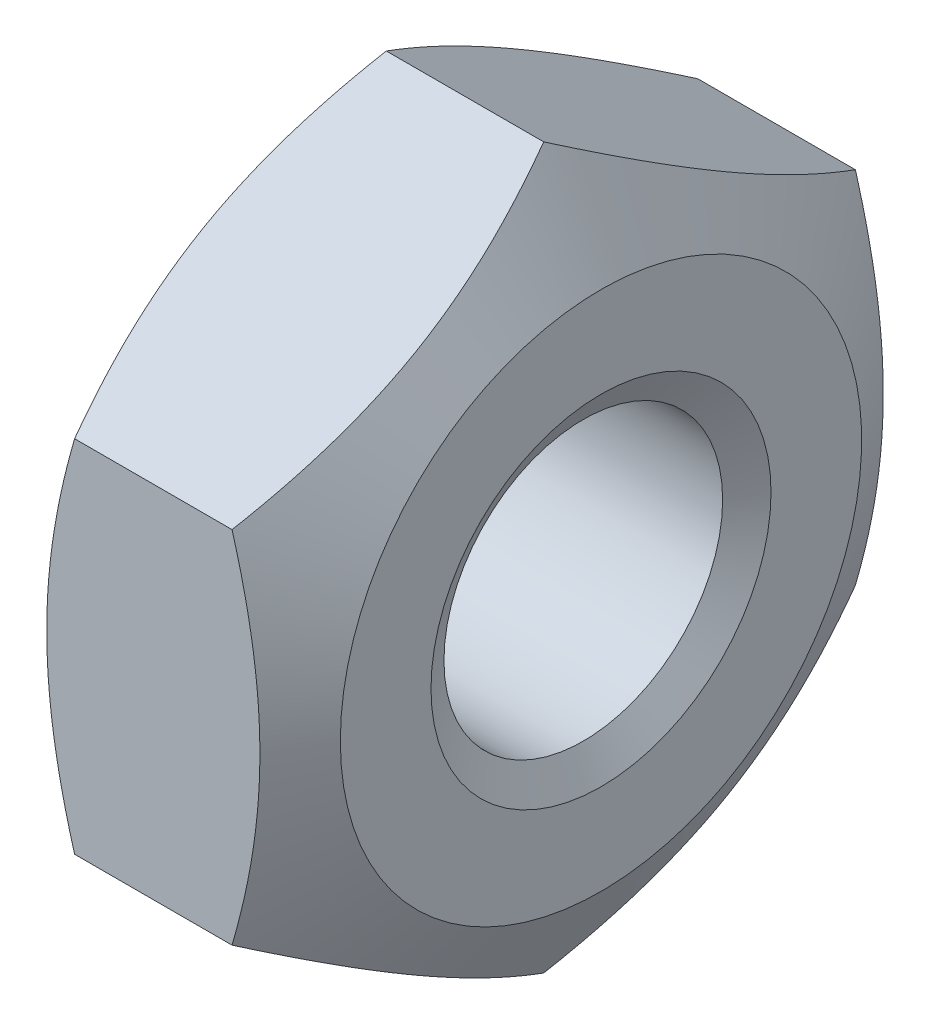
ISO-10303-21;
HEADER;
FILE_DESCRIPTION(('STEP AP214'),'2;1');
FILE_NAME('part.step','',(''),(''),'','','');
FILE_SCHEMA(('AUTOMOTIVE_DESIGN { 1 0 10303 214 1 1 1 1 }'));
ENDSEC;
DATA;
#1=APPLICATION_CONTEXT('core data for automotive mechanical design processes');
#2=APPLICATION_PROTOCOL_DEFINITION('international standard','automotive_design',2000,#1);
#3=PRODUCT_CONTEXT('',#1,'mechanical');
#4=PRODUCT('Part','Part','',(#3));
#5=PRODUCT_RELATED_PRODUCT_CATEGORY('part','',(#4));
#6=PRODUCT_DEFINITION_FORMATION('','',#4);
#7=PRODUCT_DEFINITION_CONTEXT('part definition',#1,'design');
#8=PRODUCT_DEFINITION('design','',#6,#7);
#9=PRODUCT_DEFINITION_SHAPE('','',#8);
#10=(LENGTH_UNIT() NAMED_UNIT(*) SI_UNIT(.MILLI.,.METRE.));
#11=(NAMED_UNIT(*) PLANE_ANGLE_UNIT() SI_UNIT($,.RADIAN.));
#12=(NAMED_UNIT(*) SI_UNIT($,.STERADIAN.) SOLID_ANGLE_UNIT());
#13=UNCERTAINTY_MEASURE_WITH_UNIT(LENGTH_MEASURE(1.E-05),#10,'distance_accuracy_value','');
#14=(GEOMETRIC_REPRESENTATION_CONTEXT(3) GLOBAL_UNCERTAINTY_ASSIGNED_CONTEXT((#13)) GLOBAL_UNIT_ASSIGNED_CONTEXT((#10,
#11,#12)) REPRESENTATION_CONTEXT('',''));
#15=CARTESIAN_POINT('',(0.,0.,0.));
#16=DIRECTION('',(0.,0.,1.));
#17=DIRECTION('',(1.,0.,0.));
#18=AXIS2_PLACEMENT_3D('',#15,#16,#17);
#19=CARTESIAN_POINT('',(0.,-1.58771324027147,-2.75000000000001));
#20=DIRECTION('',(0.,-0.866025403784438,-0.5));
#21=DIRECTION('',(0.,0.5,-0.866025403784438));
#22=AXIS2_PLACEMENT_3D('',#19,#20,#21);
#23=PLANE('',#22);
#24=CARTESIAN_POINT('',(1.89457227081406,-3.17542645956917,1.05677370736381E-08));
#25=CARTESIAN_POINT('',(1.93486590586192,-3.10565609170779,-0.120845841483615));
#26=CARTESIAN_POINT('',(1.97151085352844,-3.03528345852249,-0.242734829951547));
#27=CARTESIAN_POINT('',(2.0354735051396,-2.89331972966931,-0.488623230196292));
#28=CARTESIAN_POINT('',(2.06276858399163,-2.82172611238506,-0.612627009503181));
#29=CARTESIAN_POINT('',(2.10525534272448,-2.67942610375502,-0.859097852001737));
#30=CARTESIAN_POINT('',(2.12072982850071,-2.60874160090861,-0.981527003096313));
#31=CARTESIAN_POINT('',(2.13919968008389,-2.46704017425595,-1.22696107418617));
#32=CARTESIAN_POINT('',(2.14221034418956,-2.3960237651429,-1.34996510270803));
#33=CARTESIAN_POINT('',(2.13593113617861,-2.26333722314919,-1.57978493477586));
#34=CARTESIAN_POINT('',(2.12818301754884,-2.20164717955248,-1.6866352246561));
#35=CARTESIAN_POINT('',(2.10363099522736,-2.07866898287502,-1.89963970956128));
#36=CARTESIAN_POINT('',(2.08681871282409,-2.0173812548254,-2.00579316841064));
#37=CARTESIAN_POINT('',(2.04479126098825,-1.89414971139675,-2.21923646271352));
#38=CARTESIAN_POINT('',(2.01939802304476,-1.83222148476626,-2.32649929766287));
#39=CARTESIAN_POINT('',(1.96176610839163,-1.7092884238522,-2.53942560510136));
#40=CARTESIAN_POINT('',(1.92954096419356,-1.64828201586918,-2.64509180331791));
#41=CARTESIAN_POINT('',(1.8945722778935,-1.58771322661182,-2.75000002365922));
#42=B_SPLINE_CURVE_WITH_KNOTS('',3,(#24,#25,#26,#27,#28,#29,#30,#31,#32,#33,#34,#35,#36,#37,#38,
#39,#40,#41),.UNSPECIFIED.,.F.,.F.,(4,2,2,2,2,2,2,2,4),(0.,0.435897020207212,0.872841506597175,
1.29897296964876,1.72458123661091,2.09509821932502,2.46595828840692,2.84504225726385,
3.22338224444981),.UNSPECIFIED.);
#43=CARTESIAN_POINT('',(1.89457229259446,-3.17542646873979,2.04436595744794E-08));
#44=VERTEX_POINT('',#43);
#45=CARTESIAN_POINT('',(1.89457228097589,-1.58771323195066,-2.75000001441206));
#46=VERTEX_POINT('',#45);
#47=EDGE_CURVE('E168',#44,#46,#42,.T.);
#48=ORIENTED_EDGE('',*,*,#47,.F.);
#49=DIRECTION('',(1.,0.,0.));
#50=VECTOR('',#49,1.);
#51=CARTESIAN_POINT('',(0.,-3.17542648054294,0.));
#52=LINE('',#51,#50);
#53=CARTESIAN_POINT('',(0.505427707428921,-3.17542646874066,-2.0442152704221E-08));
#54=VERTEX_POINT('',#53);
#55=EDGE_CURVE('E87',#54,#44,#52,.T.);
#56=ORIENTED_EDGE('',*,*,#55,.F.);
#57=CARTESIAN_POINT('',(0.505427746507373,-1.58771319443364,-2.75000000441103));
#58=CARTESIAN_POINT('',(0.465134105039347,-1.65748359604145,-2.62915417201391));
#59=CARTESIAN_POINT('',(0.428489154182361,-1.72785624345342,-2.50726519094581));
#60=CARTESIAN_POINT('',(0.364526499117004,-1.86981998354074,-2.26137679473498));
#61=CARTESIAN_POINT('',(0.337231420003046,-1.94141359779052,-2.1373730120371));
#62=CARTESIAN_POINT('',(0.294744660121934,-2.08371360503,-1.89090216579758));
#63=CARTESIAN_POINT('',(0.279270173465292,-2.15439810940401,-1.76847301428399));
#64=CARTESIAN_POINT('',(0.260800320495573,-2.29609953795851,-1.52303894151777));
#65=CARTESIAN_POINT('',(0.257789655886369,-2.36711594744735,-1.40003491173938));
#66=CARTESIAN_POINT('',(0.264068862977007,-2.49980248732801,-1.17021508295227));
#67=CARTESIAN_POINT('',(0.271816980675713,-2.56149252839911,-1.06336479757543));
#68=CARTESIAN_POINT('',(0.296369000451132,-2.68447072000099,-0.850360321556576));
#69=CARTESIAN_POINT('',(0.313181281236138,-2.74575844550078,-0.744206867089759));
#70=CARTESIAN_POINT('',(0.355208729269278,-2.86898998384326,-0.530763581568637));
#71=CARTESIAN_POINT('',(0.380601965013055,-2.9309182079399,-0.423500751015073));
#72=CARTESIAN_POINT('',(0.438233874923238,-3.05385126389786,-0.210574452174787));
#73=CARTESIAN_POINT('',(0.470459016582293,-3.11485766945809,-0.104908258161618));
#74=CARTESIAN_POINT('',(0.505427700255913,-3.17542645631665,-4.19611834037509E-08));
#75=B_SPLINE_CURVE_WITH_KNOTS('',3,(#57,#58,#59,#60,#61,#62,#63,#64,#65,#66,#67,#68,#69,#70,#71,
#72,#73,#74),.UNSPECIFIED.,.F.,.F.,(4,2,2,2,2,2,2,2,4),(0.,0.435897024645075,0.87284151524282,
1.29897298200455,1.72458125277711,2.09509821991256,2.46595827329287,2.84504222592937,
3.22338219711898),.UNSPECIFIED.);
#76=CARTESIAN_POINT('',(0.505427701742238,-1.58771319696766,-2.75000000000001));
#77=VERTEX_POINT('',#76);
#78=EDGE_CURVE('E169',#77,#54,#75,.T.);
#79=ORIENTED_EDGE('',*,*,#78,.F.);
#80=DIRECTION('',(1.,0.,0.));
#81=VECTOR('',#80,1.);
#82=CARTESIAN_POINT('',(0.,-1.58771324027146,-2.75000000000001));
#83=LINE('',#82,#81);
#84=EDGE_CURVE('E230',#46,#77,#83,.F.);
#85=ORIENTED_EDGE('',*,*,#84,.F.);
#86=EDGE_LOOP('',(#48,#56,#79,#85));
#87=FACE_BOUND('',#86,.T.);
#88=ADVANCED_FACE('F19',(#87),#23,.T.);
#89=CARTESIAN_POINT('',(0.,1.58771324027148,-2.75));
#90=DIRECTION('',(0.,0.,-1.));
#91=DIRECTION('',(0.,1.,0.));
#92=AXIS2_PLACEMENT_3D('',#89,#90,#91);
#93=PLANE('',#92);
#94=CARTESIAN_POINT('',(1.89457231077747,-1.58771315366676,-2.74999999999533));
#95=CARTESIAN_POINT('',(1.93486593417748,-1.44817239238491,-2.74999999999832));
#96=CARTESIAN_POINT('',(1.97151087553416,-1.30742711723327,-2.74999999999955));
#97=CARTESIAN_POINT('',(2.03547351934646,-1.02349965675675,-2.75000000000046));
#98=CARTESIAN_POINT('',(2.06276859671432,-0.880312428233449,-2.75000000000012));
#99=CARTESIAN_POINT('',(2.10525535149713,-0.595712418688025,-2.74999999999989));
#100=CARTESIAN_POINT('',(2.12072983479956,-0.454343414752852,-2.74999999999997));
#101=CARTESIAN_POINT('',(2.13919968211498,-0.17094056622443,-2.75000000000003));
#102=CARTESIAN_POINT('',(2.14221034442968,-0.0289077510163266,-2.75000000000001));
#103=CARTESIAN_POINT('',(2.13593113378338,0.236465315872676,-2.75));
#104=CARTESIAN_POINT('',(2.1281830151578,0.35984538899155,-2.75));
#105=CARTESIAN_POINT('',(2.10363099496908,0.60580175431812,-2.75));
#106=CARTESIAN_POINT('',(2.08681871469655,0.728377196463695,-2.75));
#107=CARTESIAN_POINT('',(2.04479126899239,0.974840254890418,-2.75));
#108=CARTESIAN_POINT('',(2.01939803512674,1.09869669368938,-2.75));
#109=CARTESIAN_POINT('',(1.96176612998237,1.34456278704099,-2.75));
#110=CARTESIAN_POINT('',(1.92954099121112,1.46657558899145,-2.75));
#111=CARTESIAN_POINT('',(1.89457231077449,1.5877131536877,-2.75));
#112=B_SPLINE_CURVE_WITH_KNOTS('',3,(#94,#95,#96,#97,#98,#99,#100,#101,#102,#103,#104,#105,#106,
#107,#108,#109,#110,#111),.UNSPECIFIED.,.F.,.F.,(4,2,2,2,2,2,2,2,4),(0.,0.435897009963025,
0.872841486394547,1.29897294108089,1.72458119955819,2.09509814012049,2.46595816700245,
2.84504209095592,3.22338203340306),.UNSPECIFIED.);
#113=CARTESIAN_POINT('',(1.8945722982772,1.58771319697959,-2.75));
#114=VERTEX_POINT('',#113);
#115=EDGE_CURVE('E144',#46,#114,#112,.T.);
#116=ORIENTED_EDGE('',*,*,#115,.F.);
#117=ORIENTED_EDGE('',*,*,#84,.T.);
#118=CARTESIAN_POINT('',(0.505427746507018,1.58771326700975,-2.74999996250901));
#119=CARTESIAN_POINT('',(0.465134105042638,1.44817250542086,-2.74999998653492));
#120=CARTESIAN_POINT('',(0.428489154188651,1.30742722768107,-2.74999999639113));
#121=CARTESIAN_POINT('',(0.364526499127754,1.02349976005014,-2.75000000361754));
#122=CARTESIAN_POINT('',(0.337231420015147,0.880312526958087,-2.75000000095768));
#123=CARTESIAN_POINT('',(0.294744660129915,0.595712509204912,-2.74999999906603));
#124=CARTESIAN_POINT('',(0.279270173469983,0.454343501630694,-2.74999999975103));
#125=CARTESIAN_POINT('',(0.26080032049632,0.170940645355993,-2.75000000024867));
#126=CARTESIAN_POINT('',(0.257789655886568,0.0289078260406684,-2.75000000006236));
#127=CARTESIAN_POINT('',(0.264068862900329,-0.236465250713732,-2.74999999994572));
#128=CARTESIAN_POINT('',(0.271816980269895,-0.359845329570219,-2.74999999998537));
#129=CARTESIAN_POINT('',(0.296368998934198,-0.605801706342706,-2.75000000001465));
#130=CARTESIAN_POINT('',(0.313181278936156,-0.728377154196906,-2.75000000000423));
#131=CARTESIAN_POINT('',(0.355208725016804,-0.974840224496556,-2.74999999999569));
#132=CARTESIAN_POINT('',(0.380601959576994,-1.09869666945257,-2.74999999999785));
#133=CARTESIAN_POINT('',(0.43823386686259,-1.34456277501165,-2.75000000000216));
#134=CARTESIAN_POINT('',(0.470459007082211,-1.46657558301208,-2.7500000000043));
#135=CARTESIAN_POINT('',(0.505427689241566,-1.58771315366405,-2.75000000000001));
#136=B_SPLINE_CURVE_WITH_KNOTS('',3,(#118,#119,#120,#121,#122,#123,#124,#125,#126,#127,#128,
#129,#130,#131,#132,#133,#134,#135),.UNSPECIFIED.,.F.,.F.,(4,2,2,2,2,2,2,2,4),(0.,
0.435897024606381,0.872841515160476,1.2989729819614,1.72458125277676,2.09509821024748,
2.4659582539273,2.84504219635957,3.22338215742263),.UNSPECIFIED.);
#137=CARTESIAN_POINT('',(0.505427701742344,1.58771326192319,-2.74999996249812));
#138=VERTEX_POINT('',#137);
#139=EDGE_CURVE('E100',#138,#77,#136,.T.);
#140=ORIENTED_EDGE('',*,*,#139,.F.);
#141=DIRECTION('',(1.,0.,0.));
#142=VECTOR('',#141,1.);
#143=CARTESIAN_POINT('',(0.,1.58771324027147,-2.75));
#144=LINE('',#143,#142);
#145=EDGE_CURVE('E232',#114,#138,#144,.F.);
#146=ORIENTED_EDGE('',*,*,#145,.F.);
#147=EDGE_LOOP('',(#116,#117,#140,#146));
#148=FACE_BOUND('',#147,.T.);
#149=ADVANCED_FACE('F180',(#148),#93,.T.);
#150=CARTESIAN_POINT('',(0.,3.17542648054294,0.));
#151=DIRECTION('',(0.,0.866025403784439,-0.499999999999999));
#152=DIRECTION('',(0.,0.499999999999999,0.866025403784439));
#153=AXIS2_PLACEMENT_3D('',#150,#151,#152);
#154=PLANE('',#153);
#155=CARTESIAN_POINT('',(1.89457225351307,1.58771319442703,-2.75000000444026));
#156=CARTESIAN_POINT('',(1.93486589497535,1.65748359602424,-2.62915417205011));
#157=CARTESIAN_POINT('',(1.97151084582923,1.72785624342819,-2.50726519099121));
#158=CARTESIAN_POINT('',(2.03547350089163,1.86981998350092,-2.26137679480222));
#159=CARTESIAN_POINT('',(2.06276858000585,1.94141359774412,-2.137373012117));
#160=CARTESIAN_POINT('',(2.1052553398936,2.08371360498325,-1.89090216587898));
#161=CARTESIAN_POINT('',(2.12072982655448,2.15439810936368,-1.76847301435396));
#162=CARTESIAN_POINT('',(2.13919967952989,2.29609953793234,-1.52303894156297));
#163=CARTESIAN_POINT('',(2.14221034414046,2.36711594742893,-1.40003491177124));
#164=CARTESIAN_POINT('',(2.1359311371278,2.49980248570739,-1.17021508575928));
#165=CARTESIAN_POINT('',(2.12818301975828,2.56149252517198,-1.06336480316497));
#166=CARTESIAN_POINT('',(2.10363100109331,2.68447071358757,-0.850360332664929));
#167=CARTESIAN_POINT('',(2.08681872109064,2.74575843750764,-0.744206880934282));
#168=CARTESIAN_POINT('',(2.04479127500786,2.8689899726541,-0.530763600948822));
#169=CARTESIAN_POINT('',(2.01939804044624,2.93091819513601,-0.423500773192034));
#170=CARTESIAN_POINT('',(1.96176613315728,3.05385124792326,-0.2105744798436));
#171=CARTESIAN_POINT('',(1.92954099293573,3.11485765192727,-0.104908288525876));
#172=CARTESIAN_POINT('',(1.89457231077428,3.17542643725142,-7.49831167931624E-08));
#173=B_SPLINE_CURVE_WITH_KNOTS('',3,(#155,#156,#157,#158,#159,#160,#161,#162,#163,#164,#165,
#166,#167,#168,#169,#170,#171,#172),.UNSPECIFIED.,.F.,.F.,(4,2,2,2,2,2,2,2,4),(0.,
0.435897024608019,0.87284151516402,1.29897298196651,1.72458125278331,2.09509821026601,
2.46595825395791,2.845042196403,3.22338215747871),.UNSPECIFIED.);
#174=CARTESIAN_POINT('',(1.8945722982771,3.17542645889718,-3.74915576838543E-08));
#175=VERTEX_POINT('',#174);
#176=EDGE_CURVE('E127',#114,#175,#173,.T.);
#177=ORIENTED_EDGE('',*,*,#176,.F.);
#178=ORIENTED_EDGE('',*,*,#145,.T.);
#179=CARTESIAN_POINT('',(0.505427746504817,3.17542646146978,4.19166417552618E-08));
#180=CARTESIAN_POINT('',(0.465134105045911,3.10565610147363,-0.120845814491873));
#181=CARTESIAN_POINT('',(0.428489154193903,3.03528347113601,-0.242734805403521));
#182=CARTESIAN_POINT('',(0.36452649913376,2.8933197435765,-0.488623208815566));
#183=CARTESIAN_POINT('',(0.337231420019929,2.82172612472813,-0.612626988841034));
#184=CARTESIAN_POINT('',(0.294744660132919,2.6794261142143,-0.859097833186763));
#185=CARTESIAN_POINT('',(0.279270173472425,2.60874161102027,-0.981526985396068));
#186=CARTESIAN_POINT('',(0.260800320497352,2.46704018331388,-1.22696105868345));
#187=CARTESIAN_POINT('',(0.257789655886746,2.39602377349503,-1.34996508828837));
#188=CARTESIAN_POINT('',(0.264068862899024,2.26333723501577,-1.5797849141817));
#189=CARTESIAN_POINT('',(0.271816980268141,2.20164719562068,-1.6866351968142));
#190=CARTESIAN_POINT('',(0.296368998931926,2.07866900725742,-1.89963966734066));
#191=CARTESIAN_POINT('',(0.313181278933817,2.01738128332012,-2.00579311905949));
#192=CARTESIAN_POINT('',(0.355208725014677,1.89414974816054,-2.21923639903352));
#193=CARTESIAN_POINT('',(0.380601959575153,1.83222152568323,-2.32649922679097));
#194=CARTESIAN_POINT('',(0.43823386686159,1.70928847290512,-2.53942552014081));
#195=CARTESIAN_POINT('',(0.470459007081762,1.64828206890564,-2.64509171145928));
#196=CARTESIAN_POINT('',(0.505427689241766,1.58771328357483,-2.74999992499639));
#197=B_SPLINE_CURVE_WITH_KNOTS('',3,(#179,#180,#181,#182,#183,#184,#185,#186,#187,#188,#189,
#190,#191,#192,#193,#194,#195,#196),.UNSPECIFIED.,.F.,.F.,(4,2,2,2,2,2,2,2,4),(0.,
0.435897024605367,0.872841515158779,1.29897298195937,1.72458125277427,2.09509821025188,
2.46595825393869,2.84504219637802,3.223382157448),.UNSPECIFIED.);
#198=CARTESIAN_POINT('',(0.505427701745255,3.17542645889626,3.74931465495707E-08));
#199=VERTEX_POINT('',#198);
#200=EDGE_CURVE('E99',#199,#138,#197,.T.);
#201=ORIENTED_EDGE('',*,*,#200,.F.);
#202=DIRECTION('',(1.,0.,0.));
#203=VECTOR('',#202,1.);
#204=CARTESIAN_POINT('',(0.,3.17542648054294,0.));
#205=LINE('',#204,#203);
#206=EDGE_CURVE('E88',#175,#199,#205,.F.);
#207=ORIENTED_EDGE('',*,*,#206,.F.);
#208=EDGE_LOOP('',(#177,#178,#201,#207));
#209=FACE_BOUND('',#208,.T.);
#210=ADVANCED_FACE('F116',(#209),#154,.T.);
#211=CARTESIAN_POINT('',(0.,1.58771324027147,2.75));
#212=DIRECTION('',(0.,0.866025403784438,0.5));
#213=DIRECTION('',(0.,-0.5,0.866025403784438));
#214=AXIS2_PLACEMENT_3D('',#211,#212,#213);
#215=PLANE('',#214);
#216=CARTESIAN_POINT('',(1.89457225351341,3.17542646146595,-4.19218843117605E-08));
#217=CARTESIAN_POINT('',(1.93486589497558,3.10565610147309,0.120845814488547));
#218=CARTESIAN_POINT('',(1.97151084582941,3.03528347113661,0.242734805401338));
#219=CARTESIAN_POINT('',(2.03547350089174,2.89331974357748,0.488623208815009));
#220=CARTESIAN_POINT('',(2.06276858000595,2.82172612472835,0.61262698884096));
#221=CARTESIAN_POINT('',(2.10525533989367,2.67942611421358,0.859097833187729));
#222=CARTESIAN_POINT('',(2.12072982655453,2.60874161101935,0.981526985397582));
#223=CARTESIAN_POINT('',(2.13919967952991,2.46704018331243,1.22696105868605));
#224=CARTESIAN_POINT('',(2.14221034414046,2.39602377349324,1.34996508829149));
#225=CARTESIAN_POINT('',(2.13593113712778,2.26333723501292,1.57978491418661));
#226=CARTESIAN_POINT('',(2.12818301975828,2.20164719561712,1.68663519682036));
#227=CARTESIAN_POINT('',(2.10363100109337,2.07866900725245,1.89963966734927));
#228=CARTESIAN_POINT('',(2.08681872109074,2.01738128331446,2.0057931190693));
#229=CARTESIAN_POINT('',(2.04479127500809,1.89414974815344,2.21923639904582));
#230=CARTESIAN_POINT('',(2.01939804044655,1.83222152567538,2.32649922680456));
#231=CARTESIAN_POINT('',(1.96176613315776,1.70928847289583,2.5394255201569));
#232=CARTESIAN_POINT('',(1.92954099293631,1.64828206889566,2.64509171147657));
#233=CARTESIAN_POINT('',(1.89457231077496,1.58771328356417,2.74999992501484));
#234=B_SPLINE_CURVE_WITH_KNOTS('',3,(#216,#217,#218,#219,#220,#221,#222,#223,#224,#225,#226,
#227,#228,#229,#230,#231,#232,#233),.UNSPECIFIED.,.F.,.F.,(4,2,2,2,2,2,2,2,4),(0.,
0.435897024607928,0.872841515163842,1.29897298196626,1.72458125278299,2.09509821026499,
2.46595825395618,2.84504219640054,3.22338215747551),.UNSPECIFIED.);
#235=CARTESIAN_POINT('',(1.89457229827744,1.58771326191782,2.74999996250742));
#236=VERTEX_POINT('',#235);
#237=EDGE_CURVE('E121',#175,#236,#234,.T.);
#238=ORIENTED_EDGE('',*,*,#237,.F.);
#239=ORIENTED_EDGE('',*,*,#206,.T.);
#240=CARTESIAN_POINT('',(0.505427746507073,1.58771319443051,2.75000000444361));
#241=CARTESIAN_POINT('',(0.465134105047453,1.65748359602512,2.62915417205195));
#242=CARTESIAN_POINT('',(0.428489154195069,1.72785624342784,2.50726519099272));
#243=CARTESIAN_POINT('',(0.364526499134481,1.8698199834993,2.26137679480411));
#244=CARTESIAN_POINT('',(0.337231420020581,1.94141359774247,2.13737301211962));
#245=CARTESIAN_POINT('',(0.294744660133372,2.08371360498126,1.89090216588267));
#246=CARTESIAN_POINT('',(0.279270173472747,2.15439810936138,1.76847301435799));
#247=CARTESIAN_POINT('',(0.260800320497453,2.29609953792952,1.5230389415678));
#248=CARTESIAN_POINT('',(0.257789655886758,2.36711594742588,1.40003491177651));
#249=CARTESIAN_POINT('',(0.264068862898933,2.49980248570422,1.17021508576479));
#250=CARTESIAN_POINT('',(0.271816980268173,2.56149252516892,1.06336480317028));
#251=CARTESIAN_POINT('',(0.29636899893248,2.68447071358476,0.850360332669794));
#252=CARTESIAN_POINT('',(0.313181278934772,2.74575843750496,0.744206880938912));
#253=CARTESIAN_POINT('',(0.35520872501667,2.86898997265167,0.530763600953039));
#254=CARTESIAN_POINT('',(0.380601959577794,2.93091819513369,0.423500773196071));
#255=CARTESIAN_POINT('',(0.43823386686569,3.05385124792116,0.210574479847237));
#256=CARTESIAN_POINT('',(0.470459007086674,3.1148576519253,0.104908288529292));
#257=CARTESIAN_POINT('',(0.50542768924754,3.17542643724959,7.49862921480181E-08));
#258=B_SPLINE_CURVE_WITH_KNOTS('',3,(#240,#241,#242,#243,#244,#245,#246,#247,#248,#249,#250,
#251,#252,#253,#254,#255,#256,#257),.UNSPECIFIED.,.F.,.F.,(4,2,2,2,2,2,2,2,4),(0.,
0.435897024605965,0.872841515159955,1.29897298196101,1.72458125277636,2.09509821025971,
2.46595825395226,2.84504219639767,3.2233821574737),.UNSPECIFIED.);
#259=CARTESIAN_POINT('',(0.505427701744573,1.58771319697575,2.75));
#260=VERTEX_POINT('',#259);
#261=EDGE_CURVE('E94',#260,#199,#258,.T.);
#262=ORIENTED_EDGE('',*,*,#261,.F.);
#263=DIRECTION('',(1.,0.,0.));
#264=VECTOR('',#263,1.);
#265=CARTESIAN_POINT('',(0.,1.58771324027147,2.75));
#266=LINE('',#265,#264);
#267=EDGE_CURVE('E81',#236,#260,#266,.F.);
#268=ORIENTED_EDGE('',*,*,#267,.F.);
#269=EDGE_LOOP('',(#238,#239,#262,#268));
#270=FACE_BOUND('',#269,.T.);
#271=ADVANCED_FACE('F97',(#270),#215,.T.);
#272=CARTESIAN_POINT('',(0.,-1.58771324027147,2.75));
#273=DIRECTION('',(0.,0.,1.));
#274=DIRECTION('',(1.,0.,0.));
#275=AXIS2_PLACEMENT_3D('',#272,#273,#274);
#276=PLANE('',#275);
#277=CARTESIAN_POINT('',(1.89457225351229,1.58771326704062,2.74999996251716));
#278=CARTESIAN_POINT('',(1.93486589497481,1.44817250545067,2.74999998653784));
#279=CARTESIAN_POINT('',(1.97151084582882,1.30742722771025,2.74999999639192));
#280=CARTESIAN_POINT('',(2.03547350089138,1.02349976007831,2.75000000361675));
#281=CARTESIAN_POINT('',(2.06276858000562,0.88031252698588,2.75000000095747));
#282=CARTESIAN_POINT('',(2.10525533989345,0.595712509231829,2.74999999906623));
#283=CARTESIAN_POINT('',(2.12072982655436,0.454343501657121,2.74999999975109));
#284=CARTESIAN_POINT('',(2.13919967952986,0.170940645381406,2.75000000024861));
#285=CARTESIAN_POINT('',(2.14221034414046,0.0289078260655577,2.75000000006234));
#286=CARTESIAN_POINT('',(2.13593113712785,-0.236465250693283,2.74999999994573));
#287=CARTESIAN_POINT('',(2.12818301975837,-0.359845329553674,2.74999999998537));
#288=CARTESIAN_POINT('',(2.10363100109349,-0.605801706333927,2.75000000001464));
#289=CARTESIAN_POINT('',(2.08681872109086,-0.728377154191988,2.75000000000422));
#290=CARTESIAN_POINT('',(2.04479127500821,-0.974840224499473,2.74999999999568));
#291=CARTESIAN_POINT('',(2.01939804044665,-1.09869666945945,2.74999999999784));
#292=CARTESIAN_POINT('',(1.96176613315782,-1.34456277502625,2.75000000000215));
#293=CARTESIAN_POINT('',(1.92954099293634,-1.46657558303044,2.7500000000043));
#294=CARTESIAN_POINT('',(1.89457231077496,-1.58771315368608,2.75));
#295=B_SPLINE_CURVE_WITH_KNOTS('',3,(#277,#278,#279,#280,#281,#282,#283,#284,#285,#286,#287,
#288,#289,#290,#291,#292,#293,#294),.UNSPECIFIED.,.F.,.F.,(4,2,2,2,2,2,2,2,4),(0.,
0.435897024608217,0.872841515164408,1.29897298196706,1.72458125278404,2.09509821026637,
2.4659582539579,2.84504219640263,3.22338215747797),.UNSPECIFIED.);
#296=CARTESIAN_POINT('',(1.89457229827744,-1.58771319697878,2.75));
#297=VERTEX_POINT('',#296);
#298=EDGE_CURVE('E43',#236,#297,#295,.T.);
#299=ORIENTED_EDGE('',*,*,#298,.F.);
#300=ORIENTED_EDGE('',*,*,#267,.T.);
#301=CARTESIAN_POINT('',(0.505427689240765,-1.58771315366414,2.75000000000126));
#302=CARTESIAN_POINT('',(0.465134065844017,-1.4481723923823,2.75000000000045));
#303=CARTESIAN_POINT('',(0.428489124489153,-1.30742711723108,2.75000000000012));
#304=CARTESIAN_POINT('',(0.364526480679043,-1.02349965675576,2.74999999999988));
#305=CARTESIAN_POINT('',(0.33723140331155,-0.88031242823326,2.74999999999997));
#306=CARTESIAN_POINT('',(0.294744648529457,-0.595712418689208,2.75000000000003));
#307=CARTESIAN_POINT('',(0.279270165227393,-0.454343414754609,2.75000000000001));
#308=CARTESIAN_POINT('',(0.260800317912275,-0.170940566227397,2.74999999999999));
#309=CARTESIAN_POINT('',(0.257789655597531,-0.0289077510199273,2.75));
#310=CARTESIAN_POINT('',(0.264068866243448,0.23646531586815,2.75));
#311=CARTESIAN_POINT('',(0.271816984868762,0.359845388986729,2.75));
#312=CARTESIAN_POINT('',(0.296369005056758,0.605801754312753,2.75));
#313=CARTESIAN_POINT('',(0.313181285328826,0.728377196458079,2.75));
#314=CARTESIAN_POINT('',(0.3552087310319,0.974840254884214,2.75));
#315=CARTESIAN_POINT('',(0.380601964896896,1.09869669368284,2.75));
#316=CARTESIAN_POINT('',(0.438233870039863,1.34456278703384,2.75));
#317=CARTESIAN_POINT('',(0.47045900881035,1.46657558898403,2.75));
#318=CARTESIAN_POINT('',(0.505427689246177,1.58771315368004,2.75));
#319=B_SPLINE_CURVE_WITH_KNOTS('',3,(#301,#302,#303,#304,#305,#306,#307,#308,#309,#310,#311,
#312,#313,#314,#315,#316,#317,#318),.UNSPECIFIED.,.F.,.F.,(4,2,2,2,2,2,2,2,4),(0.,
0.435897009960479,0.872841486389515,1.29897294107402,1.72458119954947,2.09509814011084,
2.46595816699189,2.84504209094399,3.22338203338976),.UNSPECIFIED.);
#320=CARTESIAN_POINT('',(0.505427719046457,-1.58771323195159,2.75000001441046));
#321=VERTEX_POINT('',#320);
#322=EDGE_CURVE('E23',#321,#260,#319,.T.);
#323=ORIENTED_EDGE('',*,*,#322,.F.);
#324=DIRECTION('',(1.,0.,0.));
#325=VECTOR('',#324,1.);
#326=CARTESIAN_POINT('',(0.,-1.58771324027147,2.75));
#327=LINE('',#326,#325);
#328=EDGE_CURVE('E75',#297,#321,#327,.F.);
#329=ORIENTED_EDGE('',*,*,#328,.F.);
#330=EDGE_LOOP('',(#299,#300,#323,#329));
#331=FACE_BOUND('',#330,.T.);
#332=ADVANCED_FACE('F83',(#331),#276,.T.);
#333=CARTESIAN_POINT('',(0.,-3.17542648054294,0.));
#334=DIRECTION('',(0.,-0.866025403784439,0.5));
#335=DIRECTION('',(0.,-0.5,-0.866025403784439));
#336=AXIS2_PLACEMENT_3D('',#333,#334,#335);
#337=PLANE('',#336);
#338=CARTESIAN_POINT('',(1.8945722535123,-1.58771319442582,2.75000000444134));
#339=CARTESIAN_POINT('',(1.93486589497835,-1.65748359602951,2.62915417204062));
#340=CARTESIAN_POINT('',(1.9715108458353,-1.72785624343986,2.50726519097089));
#341=CARTESIAN_POINT('',(2.03547350090224,-1.86981998352625,2.26137679475844));
#342=CARTESIAN_POINT('',(2.06276858001782,-1.94141359777672,2.13737301206057));
#343=CARTESIAN_POINT('',(2.1052553399015,-2.08371360501698,1.89090216582054));
#344=CARTESIAN_POINT('',(2.12072982655911,-2.1543981093911,1.76847301430646));
#345=CARTESIAN_POINT('',(2.13919967953062,-2.29609953794599,1.52303894153933));
#346=CARTESIAN_POINT('',(2.14221034414066,-2.36711594743511,1.40003491176053));
#347=CARTESIAN_POINT('',(2.1359311370512,-2.4998024873169,1.17021508297152));
#348=CARTESIAN_POINT('',(2.1281830193528,-2.56149252838883,1.06336479759323));
#349=CARTESIAN_POINT('',(2.10363099957755,-2.68447071999238,0.850360321571471));
#350=CARTESIAN_POINT('',(2.08681871879241,-2.74575844549301,0.744206867103206));
#351=CARTESIAN_POINT('',(2.04479127075859,-2.86898998383719,0.530763581579138));
#352=CARTESIAN_POINT('',(2.01939803501425,-2.93091820793469,0.423500751024079));
#353=CARTESIAN_POINT('',(1.96176612510264,-3.05385126389432,0.210574452180915));
#354=CARTESIAN_POINT('',(1.92954098344271,-3.11485766945534,0.104908258166364));
#355=CARTESIAN_POINT('',(1.89457229976811,-3.17542645631467,4.19645950020382E-08));
#356=B_SPLINE_CURVE_WITH_KNOTS('',3,(#338,#339,#340,#341,#342,#343,#344,#345,#346,#347,#348,
#349,#350,#351,#352,#353,#354,#355),.UNSPECIFIED.,.F.,.F.,(4,2,2,2,2,2,2,2,4),(0.,
0.435897024646792,0.872841515246513,1.29897298200992,1.72458125278405,2.09509821992444,
2.46595827330975,2.84504222595164,3.22338219714652),.UNSPECIFIED.);
#357=EDGE_CURVE('E151',#297,#44,#356,.T.);
#358=ORIENTED_EDGE('',*,*,#357,.F.);
#359=ORIENTED_EDGE('',*,*,#328,.T.);
#360=CARTESIAN_POINT('',(0.505427729201818,-3.17542645957104,-1.0556992169839E-08));
#361=CARTESIAN_POINT('',(0.465134094157791,-3.1056560917058,0.120845841492065));
#362=CARTESIAN_POINT('',(0.428489146493419,-3.03528345851918,0.24273482995862));
#363=CARTESIAN_POINT('',(0.364526494884896,-2.89331972966558,0.488623230201393));
#364=CARTESIAN_POINT('',(0.337231416033354,-2.82172611238224,0.612627009507691));
#365=CARTESIAN_POINT('',(0.294744657301505,-2.67942610375336,0.859097852004954));
#366=CARTESIAN_POINT('',(0.279270171525797,-2.60874160090719,0.981527003098838));
#367=CARTESIAN_POINT('',(0.260800319943224,-2.46704017425522,1.22696107418732));
#368=CARTESIAN_POINT('',(0.257789655837631,-2.39602376514261,1.3499651027085));
#369=CARTESIAN_POINT('',(0.264068863848414,-2.26333722314941,1.57978493477547));
#370=CARTESIAN_POINT('',(0.271816982478033,-2.2016471795528,1.68663522465554));
#371=CARTESIAN_POINT('',(0.296369004799008,-2.07866898287552,1.89963970956039));
#372=CARTESIAN_POINT('',(0.313181287201938,-2.01738125482599,2.0057931684096));
#373=CARTESIAN_POINT('',(0.355208739036917,-1.89414971139755,2.21923646271211));
#374=CARTESIAN_POINT('',(0.380601976979879,-1.8322214847672,2.32649929766123));
#375=CARTESIAN_POINT('',(0.438233891631815,-1.70928842385337,2.53942560509933));
#376=CARTESIAN_POINT('',(0.470459035829234,-1.64828201587045,2.6450918033157));
#377=CARTESIAN_POINT('',(0.505427722128587,-1.58771322661318,2.75000002365685));
#378=B_SPLINE_CURVE_WITH_KNOTS('',3,(#360,#361,#362,#363,#364,#365,#366,#367,#368,#369,#370,
#371,#372,#373,#374,#375,#376,#377),.UNSPECIFIED.,.F.,.F.,(4,2,2,2,2,2,2,2,4),(0.,
0.435897020204083,0.87284150659099,1.29897296964023,1.72458123660001,2.09509821931348,
2.46595828839477,2.84504225725061,3.22338224443548),.UNSPECIFIED.);
#379=EDGE_CURVE('E96',#54,#321,#378,.T.);
#380=ORIENTED_EDGE('',*,*,#379,.F.);
#381=ORIENTED_EDGE('',*,*,#55,.T.);
#382=EDGE_LOOP('',(#358,#359,#380,#381));
#383=FACE_BOUND('',#382,.T.);
#384=ADVANCED_FACE('F159',(#383),#337,.T.);
#385=CARTESIAN_POINT('',(0.508460280457257,0.,0.));
#386=DIRECTION('',(1.,0.,0.));
#387=DIRECTION('',(0.,0.,-1.));
#388=AXIS2_PLACEMENT_3D('',#385,#386,#387);
#389=CONICAL_SURFACE('',#388,3.18067903930341,1.04719755119744);
#390=CARTESIAN_POINT('',(7.44308044017816E-11,0.,0.));
#391=DIRECTION('',(1.,0.,0.));
#392=DIRECTION('',(0.,0.,-1.));
#393=AXIS2_PLACEMENT_3D('',#390,#391,#392);
#394=CIRCLE('',#393,2.30000000004793);
#395=CARTESIAN_POINT('',(7.44308044017816E-11,0.,-2.30000000004793));
#396=VERTEX_POINT('',#395);
#397=EDGE_CURVE('E157',#396,#396,#394,.T.);
#398=ORIENTED_EDGE('',*,*,#397,.T.);
#399=EDGE_LOOP('',(#398));
#400=FACE_BOUND('',#399,.T.);
#401=ORIENTED_EDGE('',*,*,#78,.T.);
#402=ORIENTED_EDGE('',*,*,#379,.T.);
#403=ORIENTED_EDGE('',*,*,#322,.T.);
#404=ORIENTED_EDGE('',*,*,#261,.T.);
#405=ORIENTED_EDGE('',*,*,#200,.T.);
#406=ORIENTED_EDGE('',*,*,#139,.T.);
#407=EDGE_LOOP('',(#401,#402,#403,#404,#405,#406));
#408=FACE_BOUND('',#407,.T.);
#409=ADVANCED_FACE('F92',(#400,#408),#389,.T.);
#410=CARTESIAN_POINT('',(1.89153971956557,0.,0.));
#411=DIRECTION('',(-1.,0.,0.));
#412=DIRECTION('',(0.,0.,1.));
#413=AXIS2_PLACEMENT_3D('',#410,#411,#412);
#414=CONICAL_SURFACE('',#413,3.18067903930341,1.04719755118995);
#415=ORIENTED_EDGE('',*,*,#357,.T.);
#416=ORIENTED_EDGE('',*,*,#47,.T.);
#417=ORIENTED_EDGE('',*,*,#115,.T.);
#418=ORIENTED_EDGE('',*,*,#176,.T.);
#419=ORIENTED_EDGE('',*,*,#237,.T.);
#420=ORIENTED_EDGE('',*,*,#298,.T.);
#421=EDGE_LOOP('',(#415,#416,#417,#418,#419,#420));
#422=FACE_BOUND('',#421,.T.);
#423=CARTESIAN_POINT('',(2.39999999995719,0.,0.));
#424=DIRECTION('',(-1.,0.,0.));
#425=DIRECTION('',(0.,0.,1.));
#426=AXIS2_PLACEMENT_3D('',#423,#424,#425);
#427=CIRCLE('',#426,2.30000000004793);
#428=CARTESIAN_POINT('',(2.39999999995719,0.,2.30000000004793));
#429=VERTEX_POINT('',#428);
#430=EDGE_CURVE('E222',#429,#429,#427,.F.);
#431=ORIENTED_EDGE('',*,*,#430,.F.);
#432=EDGE_LOOP('',(#431));
#433=FACE_BOUND('',#432,.T.);
#434=ADVANCED_FACE('F136',(#422,#433),#414,.T.);
#435=CARTESIAN_POINT('',(0.,0.,0.));
#436=DIRECTION('',(1.,0.,0.));
#437=DIRECTION('',(0.,0.,-1.));
#438=AXIS2_PLACEMENT_3D('',#435,#436,#437);
#439=PLANE('',#438);
#440=CARTESIAN_POINT('',(0.,0.,0.));
#441=DIRECTION('',(-1.,0.,0.));
#442=DIRECTION('',(0.,0.,1.));
#443=AXIS2_PLACEMENT_3D('',#440,#441,#442);
#444=CIRCLE('',#443,1.50013293870188);
#445=CARTESIAN_POINT('',(0.,0.,1.50013293870188));
#446=VERTEX_POINT('',#445);
#447=EDGE_CURVE('E224',#446,#446,#444,.F.);
#448=ORIENTED_EDGE('',*,*,#447,.T.);
#449=EDGE_LOOP('',(#448));
#450=FACE_BOUND('',#449,.T.);
#451=ORIENTED_EDGE('',*,*,#397,.F.);
#452=EDGE_LOOP('',(#451));
#453=FACE_BOUND('',#452,.T.);
#454=ADVANCED_FACE('F140',(#450,#453),#439,.F.);
#455=CARTESIAN_POINT('',(2.4,0.,0.));
#456=DIRECTION('',(1.,0.,0.));
#457=DIRECTION('',(0.,0.,-1.));
#458=AXIS2_PLACEMENT_3D('',#455,#456,#457);
#459=PLANE('',#458);
#460=CARTESIAN_POINT('',(2.40000000002283,0.,0.));
#461=DIRECTION('',(1.,0.,0.));
#462=DIRECTION('',(0.,0.,-1.));
#463=AXIS2_PLACEMENT_3D('',#460,#461,#462);
#464=CIRCLE('',#463,1.50013293870188);
#465=CARTESIAN_POINT('',(2.40000000002283,0.,-1.50013293870188));
#466=VERTEX_POINT('',#465);
#467=EDGE_CURVE('E219',#466,#466,#464,.F.);
#468=ORIENTED_EDGE('',*,*,#467,.T.);
#469=EDGE_LOOP('',(#468));
#470=FACE_BOUND('',#469,.T.);
#471=ORIENTED_EDGE('',*,*,#430,.T.);
#472=EDGE_LOOP('',(#471));
#473=FACE_BOUND('',#472,.T.);
#474=ADVANCED_FACE('F208',(#470,#473),#459,.T.);
#475=CARTESIAN_POINT('',(0.,0.,0.));
#476=DIRECTION('',(-1.,0.,0.));
#477=DIRECTION('',(0.,0.,1.));
#478=AXIS2_PLACEMENT_3D('',#475,#476,#477);
#479=CONICAL_SURFACE('',#478,1.50013293870188,1.04719755126118);
#480=CARTESIAN_POINT('',(0.15625,0.,0.));
#481=DIRECTION('',(1.,0.,0.));
#482=DIRECTION('',(0.,0.,-1.));
#483=AXIS2_PLACEMENT_3D('',#480,#481,#482);
#484=CIRCLE('',#483,1.2295);
#485=CARTESIAN_POINT('',(0.15625,0.,-1.2295));
#486=VERTEX_POINT('',#485);
#487=EDGE_CURVE('E34',#486,#486,#484,.T.);
#488=ORIENTED_EDGE('',*,*,#487,.T.);
#489=EDGE_LOOP('',(#488));
#490=FACE_BOUND('',#489,.T.);
#491=ORIENTED_EDGE('',*,*,#447,.F.);
#492=EDGE_LOOP('',(#491));
#493=FACE_BOUND('',#492,.T.);
#494=ADVANCED_FACE('F201',(#490,#493),#479,.F.);
#495=CARTESIAN_POINT('',(2.40000000002283,0.,0.));
#496=DIRECTION('',(1.,0.,0.));
#497=DIRECTION('',(0.,0.,-1.));
#498=AXIS2_PLACEMENT_3D('',#495,#496,#497);
#499=CONICAL_SURFACE('',#498,1.50013293870188,1.0471975511946);
#500=CARTESIAN_POINT('',(2.24375,0.,0.));
#501=DIRECTION('',(1.,0.,0.));
#502=DIRECTION('',(0.,0.,-1.));
#503=AXIS2_PLACEMENT_3D('',#500,#501,#502);
#504=CIRCLE('',#503,1.2295);
#505=CARTESIAN_POINT('',(2.24375,0.,-1.2295));
#506=VERTEX_POINT('',#505);
#507=EDGE_CURVE('E11',#506,#506,#504,.F.);
#508=ORIENTED_EDGE('',*,*,#507,.T.);
#509=EDGE_LOOP('',(#508));
#510=FACE_BOUND('',#509,.T.);
#511=ORIENTED_EDGE('',*,*,#467,.F.);
#512=EDGE_LOOP('',(#511));
#513=FACE_BOUND('',#512,.T.);
#514=ADVANCED_FACE('F195',(#510,#513),#499,.F.);
#515=CARTESIAN_POINT('',(-6.33746721500764,0.,0.));
#516=DIRECTION('',(1.,0.,0.));
#517=DIRECTION('',(0.,0.,-1.));
#518=AXIS2_PLACEMENT_3D('',#515,#516,#517);
#519=CYLINDRICAL_SURFACE('',#518,1.2295);
#520=ORIENTED_EDGE('',*,*,#487,.F.);
#521=EDGE_LOOP('',(#520));
#522=FACE_BOUND('',#521,.T.);
#523=ORIENTED_EDGE('',*,*,#507,.F.);
#524=EDGE_LOOP('',(#523));
#525=FACE_BOUND('',#524,.T.);
#526=ADVANCED_FACE('F193',(#522,#525),#519,.F.);
#527=CLOSED_SHELL('',(#88,#149,#210,#271,#332,#384,#409,#434,#454,#474,#494,#514,#526));
#528=MANIFOLD_SOLID_BREP('B1',#527);
#529=ADVANCED_BREP_SHAPE_REPRESENTATION('',(#18,#528),#14);
#530=SHAPE_DEFINITION_REPRESENTATION(#9,#529);
ENDSEC;
END-ISO-10303-21;
